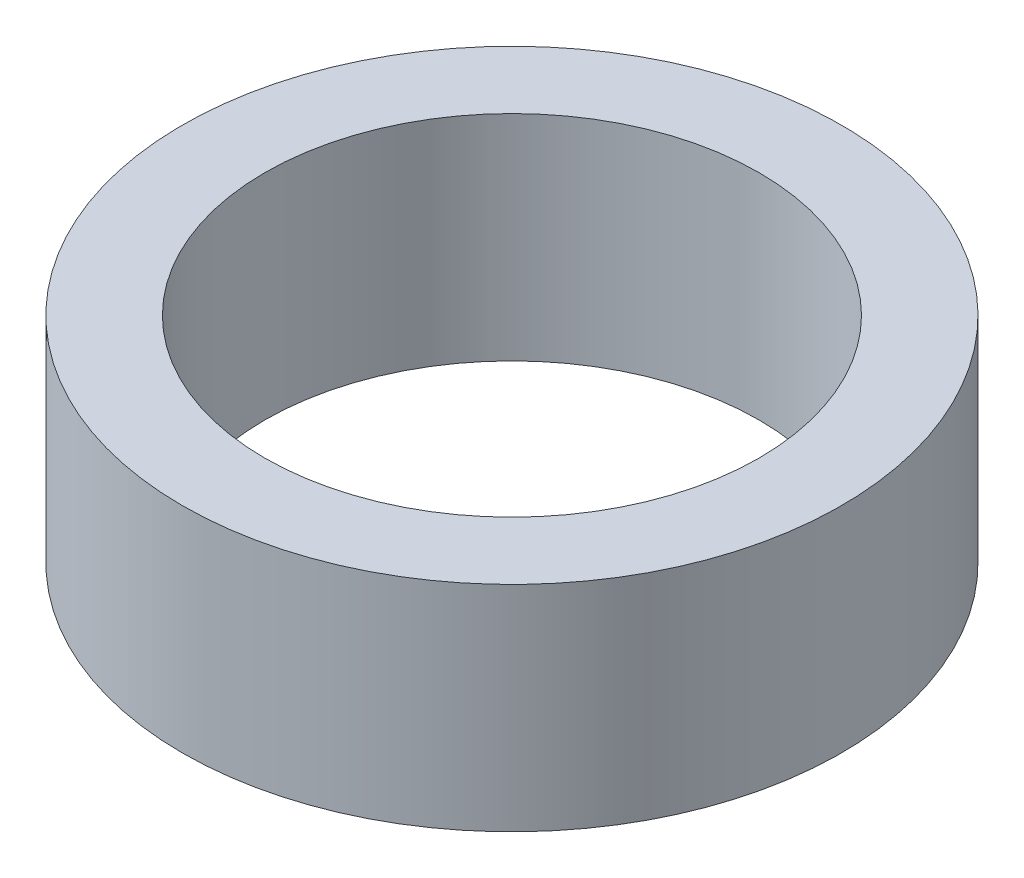
ISO-10303-21;
HEADER;
FILE_DESCRIPTION(('STEP AP214'),'2;1');
FILE_NAME('part.step','',(''),(''),'','','');
FILE_SCHEMA(('AUTOMOTIVE_DESIGN { 1 0 10303 214 1 1 1 1 }'));
ENDSEC;
DATA;
#1=APPLICATION_CONTEXT('core data for automotive mechanical design processes');
#2=APPLICATION_PROTOCOL_DEFINITION('international standard','automotive_design',2000,#1);
#3=PRODUCT_CONTEXT('',#1,'mechanical');
#4=PRODUCT('Part','Part','',(#3));
#5=PRODUCT_RELATED_PRODUCT_CATEGORY('part','',(#4));
#6=PRODUCT_DEFINITION_FORMATION('','',#4);
#7=PRODUCT_DEFINITION_CONTEXT('part definition',#1,'design');
#8=PRODUCT_DEFINITION('design','',#6,#7);
#9=PRODUCT_DEFINITION_SHAPE('','',#8);
#10=(LENGTH_UNIT() NAMED_UNIT(*) SI_UNIT(.MILLI.,.METRE.));
#11=(NAMED_UNIT(*) PLANE_ANGLE_UNIT() SI_UNIT($,.RADIAN.));
#12=(NAMED_UNIT(*) SI_UNIT($,.STERADIAN.) SOLID_ANGLE_UNIT());
#13=UNCERTAINTY_MEASURE_WITH_UNIT(LENGTH_MEASURE(1.E-05),#10,'distance_accuracy_value','');
#14=(GEOMETRIC_REPRESENTATION_CONTEXT(3) GLOBAL_UNCERTAINTY_ASSIGNED_CONTEXT((#13)) GLOBAL_UNIT_ASSIGNED_CONTEXT((#10,
#11,#12)) REPRESENTATION_CONTEXT('',''));
#15=CARTESIAN_POINT('',(0.,0.,0.));
#16=DIRECTION('',(0.,0.,1.));
#17=DIRECTION('',(1.,0.,0.));
#18=AXIS2_PLACEMENT_3D('',#15,#16,#17);
#19=CARTESIAN_POINT('',(0.,6.5,0.));
#20=DIRECTION('',(0.,1.,0.));
#21=DIRECTION('',(0.,0.,1.));
#22=AXIS2_PLACEMENT_3D('',#19,#20,#21);
#23=PLANE('',#22);
#24=CARTESIAN_POINT('',(0.,6.5,0.));
#25=DIRECTION('',(0.,1.,0.));
#26=DIRECTION('',(0.,0.,1.));
#27=AXIS2_PLACEMENT_3D('',#24,#25,#26);
#28=CIRCLE('',#27,20.);
#29=CARTESIAN_POINT('',(0.,6.5,20.));
#30=VERTEX_POINT('',#29);
#31=EDGE_CURVE('E10',#30,#30,#28,.T.);
#32=ORIENTED_EDGE('',*,*,#31,.T.);
#33=EDGE_LOOP('',(#32));
#34=FACE_BOUND('',#33,.T.);
#35=CARTESIAN_POINT('',(0.,6.5,0.));
#36=DIRECTION('',(0.,1.,0.));
#37=DIRECTION('',(0.,0.,1.));
#38=AXIS2_PLACEMENT_3D('',#35,#36,#37);
#39=CIRCLE('',#38,15.);
#40=CARTESIAN_POINT('',(0.,6.5,15.));
#41=VERTEX_POINT('',#40);
#42=EDGE_CURVE('E44',#41,#41,#39,.T.);
#43=ORIENTED_EDGE('',*,*,#42,.F.);
#44=EDGE_LOOP('',(#43));
#45=FACE_BOUND('',#44,.T.);
#46=ADVANCED_FACE('F33',(#34,#45),#23,.T.);
#47=CARTESIAN_POINT('',(0.,-6.5,0.));
#48=DIRECTION('',(0.,1.,0.));
#49=DIRECTION('',(0.,0.,1.));
#50=AXIS2_PLACEMENT_3D('',#47,#48,#49);
#51=PLANE('',#50);
#52=CARTESIAN_POINT('',(0.,-6.5,0.));
#53=DIRECTION('',(0.,1.,0.));
#54=DIRECTION('',(0.,0.,1.));
#55=AXIS2_PLACEMENT_3D('',#52,#53,#54);
#56=CIRCLE('',#55,20.);
#57=CARTESIAN_POINT('',(0.,-6.5,20.));
#58=VERTEX_POINT('',#57);
#59=EDGE_CURVE('E37',#58,#58,#56,.T.);
#60=ORIENTED_EDGE('',*,*,#59,.F.);
#61=EDGE_LOOP('',(#60));
#62=FACE_BOUND('',#61,.T.);
#63=CARTESIAN_POINT('',(0.,-6.5,0.));
#64=DIRECTION('',(0.,1.,0.));
#65=DIRECTION('',(0.,0.,1.));
#66=AXIS2_PLACEMENT_3D('',#63,#64,#65);
#67=CIRCLE('',#66,15.);
#68=CARTESIAN_POINT('',(0.,-6.5,15.));
#69=VERTEX_POINT('',#68);
#70=EDGE_CURVE('E46',#69,#69,#67,.T.);
#71=ORIENTED_EDGE('',*,*,#70,.T.);
#72=EDGE_LOOP('',(#71));
#73=FACE_BOUND('',#72,.T.);
#74=ADVANCED_FACE('F56',(#62,#73),#51,.F.);
#75=CARTESIAN_POINT('',(0.,6.5,0.));
#76=DIRECTION('',(0.,-1.,0.));
#77=DIRECTION('',(0.,0.,-1.));
#78=AXIS2_PLACEMENT_3D('',#75,#76,#77);
#79=CYLINDRICAL_SURFACE('',#78,20.);
#80=ORIENTED_EDGE('',*,*,#31,.F.);
#81=EDGE_LOOP('',(#80));
#82=FACE_BOUND('',#81,.T.);
#83=ORIENTED_EDGE('',*,*,#59,.T.);
#84=EDGE_LOOP('',(#83));
#85=FACE_BOUND('',#84,.T.);
#86=ADVANCED_FACE('F35',(#82,#85),#79,.T.);
#87=CARTESIAN_POINT('',(0.,6.5,0.));
#88=DIRECTION('',(0.,-1.,0.));
#89=DIRECTION('',(0.,0.,-1.));
#90=AXIS2_PLACEMENT_3D('',#87,#88,#89);
#91=CYLINDRICAL_SURFACE('',#90,15.);
#92=ORIENTED_EDGE('',*,*,#42,.T.);
#93=EDGE_LOOP('',(#92));
#94=FACE_BOUND('',#93,.T.);
#95=ORIENTED_EDGE('',*,*,#70,.F.);
#96=EDGE_LOOP('',(#95));
#97=FACE_BOUND('',#96,.T.);
#98=ADVANCED_FACE('F52',(#94,#97),#91,.F.);
#99=CLOSED_SHELL('',(#46,#74,#86,#98));
#100=MANIFOLD_SOLID_BREP('B2',#99);
#101=ADVANCED_BREP_SHAPE_REPRESENTATION('',(#18,#100),#14);
#102=SHAPE_DEFINITION_REPRESENTATION(#9,#101);
ENDSEC;
END-ISO-10303-21;
